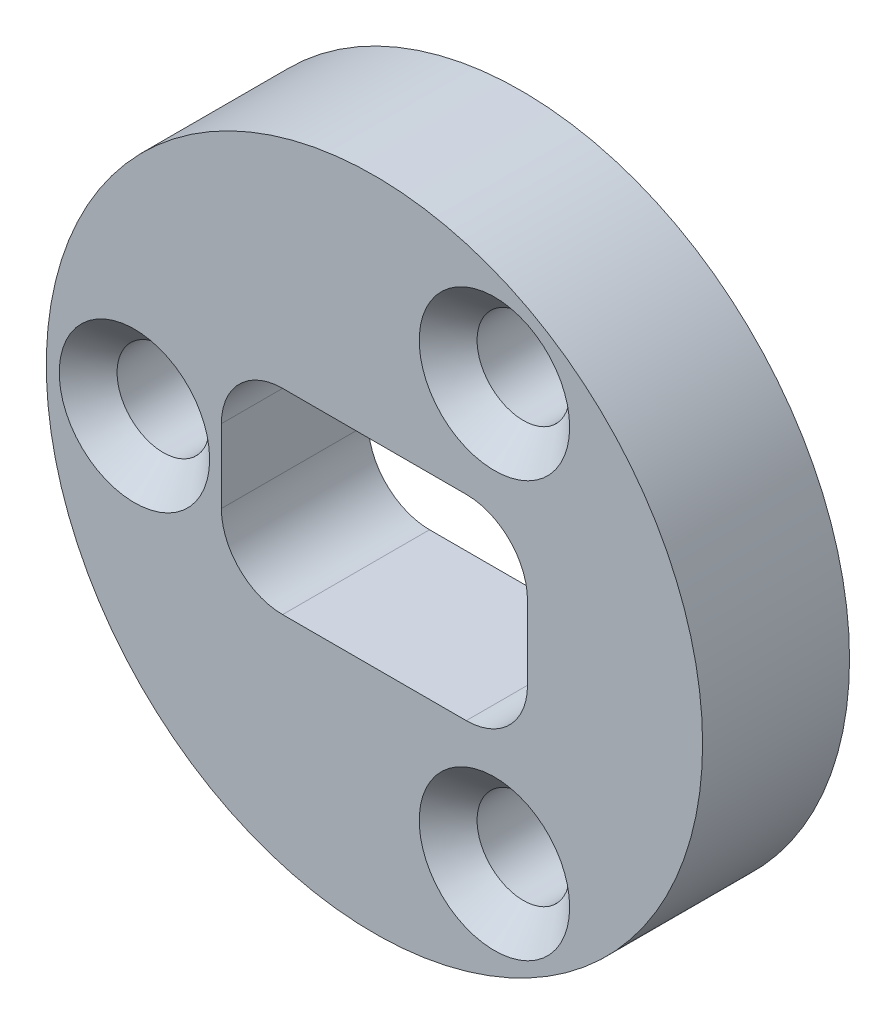
ISO-10303-21;
HEADER;
FILE_DESCRIPTION(('STEP AP214'),'2;1');
FILE_NAME('part.step','',(''),(''),'','','');
FILE_SCHEMA(('AUTOMOTIVE_DESIGN { 1 0 10303 214 1 1 1 1 }'));
ENDSEC;
DATA;
#1=APPLICATION_CONTEXT('core data for automotive mechanical design processes');
#2=APPLICATION_PROTOCOL_DEFINITION('international standard','automotive_design',2000,#1);
#3=PRODUCT_CONTEXT('',#1,'mechanical');
#4=PRODUCT('Part','Part','',(#3));
#5=PRODUCT_RELATED_PRODUCT_CATEGORY('part','',(#4));
#6=PRODUCT_DEFINITION_FORMATION('','',#4);
#7=PRODUCT_DEFINITION_CONTEXT('part definition',#1,'design');
#8=PRODUCT_DEFINITION('design','',#6,#7);
#9=PRODUCT_DEFINITION_SHAPE('','',#8);
#10=(LENGTH_UNIT() NAMED_UNIT(*) SI_UNIT(.MILLI.,.METRE.));
#11=(NAMED_UNIT(*) PLANE_ANGLE_UNIT() SI_UNIT($,.RADIAN.));
#12=(NAMED_UNIT(*) SI_UNIT($,.STERADIAN.) SOLID_ANGLE_UNIT());
#13=UNCERTAINTY_MEASURE_WITH_UNIT(LENGTH_MEASURE(1.E-05),#10,'distance_accuracy_value','');
#14=(GEOMETRIC_REPRESENTATION_CONTEXT(3) GLOBAL_UNCERTAINTY_ASSIGNED_CONTEXT((#13)) GLOBAL_UNIT_ASSIGNED_CONTEXT((#10,
#11,#12)) REPRESENTATION_CONTEXT('',''));
#15=CARTESIAN_POINT('',(0.,0.,0.));
#16=DIRECTION('',(0.,0.,1.));
#17=DIRECTION('',(1.,0.,0.));
#18=AXIS2_PLACEMENT_3D('',#15,#16,#17);
#19=CARTESIAN_POINT('',(0.,0.,3.81));
#20=DIRECTION('',(0.,0.,-1.));
#21=DIRECTION('',(-1.,0.,0.));
#22=AXIS2_PLACEMENT_3D('',#19,#20,#21);
#23=CYLINDRICAL_SURFACE('',#22,8.509);
#24=CARTESIAN_POINT('',(0.,0.,3.81));
#25=DIRECTION('',(0.,0.,1.));
#26=DIRECTION('',(1.,0.,0.));
#27=AXIS2_PLACEMENT_3D('',#24,#25,#26);
#28=CIRCLE('',#27,8.509);
#29=CARTESIAN_POINT('',(8.509,0.,3.81));
#30=VERTEX_POINT('',#29);
#31=EDGE_CURVE('E152',#30,#30,#28,.T.);
#32=ORIENTED_EDGE('',*,*,#31,.F.);
#33=EDGE_LOOP('',(#32));
#34=FACE_BOUND('',#33,.T.);
#35=CARTESIAN_POINT('',(0.,0.,0.));
#36=DIRECTION('',(0.,0.,1.));
#37=DIRECTION('',(1.,0.,0.));
#38=AXIS2_PLACEMENT_3D('',#35,#36,#37);
#39=CIRCLE('',#38,8.509);
#40=CARTESIAN_POINT('',(8.509,0.,0.));
#41=VERTEX_POINT('',#40);
#42=EDGE_CURVE('E156',#41,#41,#39,.T.);
#43=ORIENTED_EDGE('',*,*,#42,.T.);
#44=EDGE_LOOP('',(#43));
#45=FACE_BOUND('',#44,.T.);
#46=ADVANCED_FACE('F41',(#34,#45),#23,.T.);
#47=CARTESIAN_POINT('',(0.,0.,3.81));
#48=DIRECTION('',(0.,0.,1.));
#49=DIRECTION('',(1.,0.,0.));
#50=AXIS2_PLACEMENT_3D('',#47,#48,#49);
#51=PLANE('',#50);
#52=CARTESIAN_POINT('',(3.11150000000005,-5.38927608775056,3.81));
#53=DIRECTION('',(0.,0.,1.));
#54=DIRECTION('',(1.,0.,0.));
#55=AXIS2_PLACEMENT_3D('',#52,#53,#54);
#56=CIRCLE('',#55,1.94999999999999);
#57=CARTESIAN_POINT('',(5.06150000000004,-5.38927608775056,3.81));
#58=VERTEX_POINT('',#57);
#59=EDGE_CURVE('E210',#58,#58,#56,.F.);
#60=ORIENTED_EDGE('',*,*,#59,.T.);
#61=EDGE_LOOP('',(#60));
#62=FACE_BOUND('',#61,.T.);
#63=CARTESIAN_POINT('',(-6.223,0.,3.81));
#64=DIRECTION('',(0.,0.,1.));
#65=DIRECTION('',(1.,0.,0.));
#66=AXIS2_PLACEMENT_3D('',#63,#64,#65);
#67=CIRCLE('',#66,1.94999999999999);
#68=CARTESIAN_POINT('',(-4.27300000000001,0.,3.81));
#69=VERTEX_POINT('',#68);
#70=EDGE_CURVE('E206',#69,#69,#67,.F.);
#71=ORIENTED_EDGE('',*,*,#70,.T.);
#72=EDGE_LOOP('',(#71));
#73=FACE_BOUND('',#72,.T.);
#74=CARTESIAN_POINT('',(3.11150000000003,5.38927608775061,3.81));
#75=DIRECTION('',(0.,0.,1.));
#76=DIRECTION('',(1.,0.,0.));
#77=AXIS2_PLACEMENT_3D('',#74,#75,#76);
#78=CIRCLE('',#77,1.94999999999999);
#79=CARTESIAN_POINT('',(5.06150000000002,5.38927608775061,3.81));
#80=VERTEX_POINT('',#79);
#81=EDGE_CURVE('E202',#80,#80,#78,.F.);
#82=ORIENTED_EDGE('',*,*,#81,.T.);
#83=EDGE_LOOP('',(#82));
#84=FACE_BOUND('',#83,.T.);
#85=DIRECTION('',(0.,-1.,0.));
#86=VECTOR('',#85,1.);
#87=CARTESIAN_POINT('',(-3.96875,2.54,3.81));
#88=LINE('',#87,#86);
#89=CARTESIAN_POINT('',(-3.96875,0.9525,3.81));
#90=VERTEX_POINT('',#89);
#91=CARTESIAN_POINT('',(-3.96875,-0.952500000000001,3.81));
#92=VERTEX_POINT('',#91);
#93=EDGE_CURVE('E148',#90,#92,#88,.T.);
#94=ORIENTED_EDGE('',*,*,#93,.F.);
#95=CARTESIAN_POINT('',(-2.38125,0.9525,3.81));
#96=DIRECTION('',(0.,0.,1.));
#97=DIRECTION('',(1.,0.,0.));
#98=AXIS2_PLACEMENT_3D('',#95,#96,#97);
#99=CIRCLE('',#98,1.5875);
#100=CARTESIAN_POINT('',(-2.38125,2.54,3.81));
#101=VERTEX_POINT('',#100);
#102=EDGE_CURVE('E192',#90,#101,#99,.F.);
#103=ORIENTED_EDGE('',*,*,#102,.T.);
#104=DIRECTION('',(-1.,0.,0.));
#105=VECTOR('',#104,1.);
#106=CARTESIAN_POINT('',(-3.96875,2.54,3.81));
#107=LINE('',#106,#105);
#108=CARTESIAN_POINT('',(2.38125,2.54,3.81));
#109=VERTEX_POINT('',#108);
#110=EDGE_CURVE('E141',#109,#101,#107,.T.);
#111=ORIENTED_EDGE('',*,*,#110,.F.);
#112=CARTESIAN_POINT('',(2.38125,0.9525,3.81));
#113=DIRECTION('',(0.,0.,1.));
#114=DIRECTION('',(1.,0.,0.));
#115=AXIS2_PLACEMENT_3D('',#112,#113,#114);
#116=CIRCLE('',#115,1.5875);
#117=CARTESIAN_POINT('',(3.96875,0.9525,3.81));
#118=VERTEX_POINT('',#117);
#119=EDGE_CURVE('E139',#109,#118,#116,.F.);
#120=ORIENTED_EDGE('',*,*,#119,.T.);
#121=DIRECTION('',(0.,1.,0.));
#122=VECTOR('',#121,1.);
#123=CARTESIAN_POINT('',(3.96875,2.54,3.81));
#124=LINE('',#123,#122);
#125=CARTESIAN_POINT('',(3.96875,-0.952500000000002,3.81));
#126=VERTEX_POINT('',#125);
#127=EDGE_CURVE('E128',#126,#118,#124,.T.);
#128=ORIENTED_EDGE('',*,*,#127,.F.);
#129=CARTESIAN_POINT('',(2.38125,-0.952500000000001,3.81));
#130=DIRECTION('',(0.,0.,1.));
#131=DIRECTION('',(1.,0.,0.));
#132=AXIS2_PLACEMENT_3D('',#129,#130,#131);
#133=CIRCLE('',#132,1.5875);
#134=CARTESIAN_POINT('',(2.38125,-2.54,3.81));
#135=VERTEX_POINT('',#134);
#136=EDGE_CURVE('E110',#126,#135,#133,.F.);
#137=ORIENTED_EDGE('',*,*,#136,.T.);
#138=DIRECTION('',(1.,0.,0.));
#139=VECTOR('',#138,1.);
#140=CARTESIAN_POINT('',(-3.96875,-2.54,3.81));
#141=LINE('',#140,#139);
#142=CARTESIAN_POINT('',(-2.38125,-2.54,3.81));
#143=VERTEX_POINT('',#142);
#144=EDGE_CURVE('E142',#143,#135,#141,.T.);
#145=ORIENTED_EDGE('',*,*,#144,.F.);
#146=CARTESIAN_POINT('',(-2.38125,-0.952500000000001,3.81));
#147=DIRECTION('',(0.,0.,1.));
#148=DIRECTION('',(1.,0.,0.));
#149=AXIS2_PLACEMENT_3D('',#146,#147,#148);
#150=CIRCLE('',#149,1.5875);
#151=EDGE_CURVE('E182',#143,#92,#150,.F.);
#152=ORIENTED_EDGE('',*,*,#151,.T.);
#153=EDGE_LOOP('',(#94,#103,#111,#120,#128,#137,#145,#152));
#154=FACE_BOUND('',#153,.T.);
#155=ORIENTED_EDGE('',*,*,#31,.T.);
#156=EDGE_LOOP('',(#155));
#157=FACE_BOUND('',#156,.T.);
#158=ADVANCED_FACE('F136',(#62,#73,#84,#154,#157),#51,.T.);
#159=CARTESIAN_POINT('',(0.,0.,0.));
#160=DIRECTION('',(0.,0.,1.));
#161=DIRECTION('',(1.,0.,0.));
#162=AXIS2_PLACEMENT_3D('',#159,#160,#161);
#163=PLANE('',#162);
#164=CARTESIAN_POINT('',(-6.223,0.,0.));
#165=DIRECTION('',(0.,0.,1.));
#166=DIRECTION('',(1.,0.,0.));
#167=AXIS2_PLACEMENT_3D('',#164,#165,#166);
#168=CIRCLE('',#167,1.2);
#169=CARTESIAN_POINT('',(-5.023,0.,0.));
#170=VERTEX_POINT('',#169);
#171=EDGE_CURVE('E300',#170,#170,#168,.T.);
#172=ORIENTED_EDGE('',*,*,#171,.T.);
#173=EDGE_LOOP('',(#172));
#174=FACE_BOUND('',#173,.T.);
#175=CARTESIAN_POINT('',(3.11150000000003,5.38927608775061,0.));
#176=DIRECTION('',(0.,0.,1.));
#177=DIRECTION('',(1.,0.,0.));
#178=AXIS2_PLACEMENT_3D('',#175,#176,#177);
#179=CIRCLE('',#178,1.2);
#180=CARTESIAN_POINT('',(4.31150000000003,5.38927608775061,0.));
#181=VERTEX_POINT('',#180);
#182=EDGE_CURVE('E295',#181,#181,#179,.T.);
#183=ORIENTED_EDGE('',*,*,#182,.T.);
#184=EDGE_LOOP('',(#183));
#185=FACE_BOUND('',#184,.T.);
#186=CARTESIAN_POINT('',(3.11150000000005,-5.38927608775056,0.));
#187=DIRECTION('',(0.,0.,1.));
#188=DIRECTION('',(1.,0.,0.));
#189=AXIS2_PLACEMENT_3D('',#186,#187,#188);
#190=CIRCLE('',#189,1.2);
#191=CARTESIAN_POINT('',(4.31150000000005,-5.38927608775056,0.));
#192=VERTEX_POINT('',#191);
#193=EDGE_CURVE('E286',#192,#192,#190,.T.);
#194=ORIENTED_EDGE('',*,*,#193,.T.);
#195=EDGE_LOOP('',(#194));
#196=FACE_BOUND('',#195,.T.);
#197=DIRECTION('',(0.,1.,0.));
#198=VECTOR('',#197,1.);
#199=CARTESIAN_POINT('',(3.96875,2.54,0.));
#200=LINE('',#199,#198);
#201=CARTESIAN_POINT('',(3.96875,-0.952500000000002,0.));
#202=VERTEX_POINT('',#201);
#203=CARTESIAN_POINT('',(3.96875,0.9525,0.));
#204=VERTEX_POINT('',#203);
#205=EDGE_CURVE('E130',#202,#204,#200,.T.);
#206=ORIENTED_EDGE('',*,*,#205,.T.);
#207=CARTESIAN_POINT('',(2.38125,0.9525,0.));
#208=DIRECTION('',(0.,0.,1.));
#209=DIRECTION('',(1.,0.,0.));
#210=AXIS2_PLACEMENT_3D('',#207,#208,#209);
#211=CIRCLE('',#210,1.5875);
#212=CARTESIAN_POINT('',(2.38125,2.54,0.));
#213=VERTEX_POINT('',#212);
#214=EDGE_CURVE('E65',#204,#213,#211,.T.);
#215=ORIENTED_EDGE('',*,*,#214,.T.);
#216=DIRECTION('',(-1.,0.,0.));
#217=VECTOR('',#216,1.);
#218=CARTESIAN_POINT('',(-3.96875,2.54,0.));
#219=LINE('',#218,#217);
#220=CARTESIAN_POINT('',(-2.38125,2.54,0.));
#221=VERTEX_POINT('',#220);
#222=EDGE_CURVE('E160',#213,#221,#219,.T.);
#223=ORIENTED_EDGE('',*,*,#222,.T.);
#224=CARTESIAN_POINT('',(-2.38125,0.9525,0.));
#225=DIRECTION('',(0.,0.,1.));
#226=DIRECTION('',(1.,0.,0.));
#227=AXIS2_PLACEMENT_3D('',#224,#225,#226);
#228=CIRCLE('',#227,1.5875);
#229=CARTESIAN_POINT('',(-3.96875,0.9525,0.));
#230=VERTEX_POINT('',#229);
#231=EDGE_CURVE('E195',#221,#230,#228,.T.);
#232=ORIENTED_EDGE('',*,*,#231,.T.);
#233=DIRECTION('',(0.,-1.,0.));
#234=VECTOR('',#233,1.);
#235=CARTESIAN_POINT('',(-3.96875,2.54,0.));
#236=LINE('',#235,#234);
#237=CARTESIAN_POINT('',(-3.96875,-0.952500000000001,0.));
#238=VERTEX_POINT('',#237);
#239=EDGE_CURVE('E146',#230,#238,#236,.T.);
#240=ORIENTED_EDGE('',*,*,#239,.T.);
#241=CARTESIAN_POINT('',(-2.38125,-0.952500000000001,0.));
#242=DIRECTION('',(0.,0.,1.));
#243=DIRECTION('',(1.,0.,0.));
#244=AXIS2_PLACEMENT_3D('',#241,#242,#243);
#245=CIRCLE('',#244,1.5875);
#246=CARTESIAN_POINT('',(-2.38125,-2.54,0.));
#247=VERTEX_POINT('',#246);
#248=EDGE_CURVE('E185',#238,#247,#245,.T.);
#249=ORIENTED_EDGE('',*,*,#248,.T.);
#250=DIRECTION('',(1.,0.,0.));
#251=VECTOR('',#250,1.);
#252=CARTESIAN_POINT('',(-3.96875,-2.54,0.));
#253=LINE('',#252,#251);
#254=CARTESIAN_POINT('',(2.38125,-2.54,0.));
#255=VERTEX_POINT('',#254);
#256=EDGE_CURVE('E280',#247,#255,#253,.T.);
#257=ORIENTED_EDGE('',*,*,#256,.T.);
#258=CARTESIAN_POINT('',(2.38125,-0.952500000000001,0.));
#259=DIRECTION('',(0.,0.,1.));
#260=DIRECTION('',(1.,0.,0.));
#261=AXIS2_PLACEMENT_3D('',#258,#259,#260);
#262=CIRCLE('',#261,1.5875);
#263=EDGE_CURVE('E121',#255,#202,#262,.T.);
#264=ORIENTED_EDGE('',*,*,#263,.T.);
#265=EDGE_LOOP('',(#206,#215,#223,#232,#240,#249,#257,#264));
#266=FACE_BOUND('',#265,.T.);
#267=ORIENTED_EDGE('',*,*,#42,.F.);
#268=EDGE_LOOP('',(#267));
#269=FACE_BOUND('',#268,.T.);
#270=ADVANCED_FACE('F241',(#174,#185,#196,#266,#269),#163,.F.);
#271=CARTESIAN_POINT('',(-3.96875,2.54,0.));
#272=DIRECTION('',(-1.,0.,0.));
#273=DIRECTION('',(0.,-1.,0.));
#274=AXIS2_PLACEMENT_3D('',#271,#272,#273);
#275=PLANE('',#274);
#276=ORIENTED_EDGE('',*,*,#93,.T.);
#277=DIRECTION('',(0.,0.,1.));
#278=VECTOR('',#277,1.);
#279=CARTESIAN_POINT('',(-3.96875,-0.952500000000001,0.));
#280=LINE('',#279,#278);
#281=EDGE_CURVE('E172',#92,#238,#280,.F.);
#282=ORIENTED_EDGE('',*,*,#281,.T.);
#283=ORIENTED_EDGE('',*,*,#239,.F.);
#284=DIRECTION('',(0.,0.,1.));
#285=VECTOR('',#284,1.);
#286=CARTESIAN_POINT('',(-3.96875,0.9525,3.81));
#287=LINE('',#286,#285);
#288=EDGE_CURVE('E168',#230,#90,#287,.T.);
#289=ORIENTED_EDGE('',*,*,#288,.T.);
#290=EDGE_LOOP('',(#276,#282,#283,#289));
#291=FACE_BOUND('',#290,.T.);
#292=ADVANCED_FACE('F277',(#291),#275,.F.);
#293=CARTESIAN_POINT('',(-3.96875,2.54,0.));
#294=DIRECTION('',(0.,1.,0.));
#295=DIRECTION('',(0.,0.,1.));
#296=AXIS2_PLACEMENT_3D('',#293,#294,#295);
#297=PLANE('',#296);
#298=ORIENTED_EDGE('',*,*,#222,.F.);
#299=DIRECTION('',(0.,0.,1.));
#300=VECTOR('',#299,1.);
#301=CARTESIAN_POINT('',(2.38125,2.54,3.81));
#302=LINE('',#301,#300);
#303=EDGE_CURVE('E122',#213,#109,#302,.T.);
#304=ORIENTED_EDGE('',*,*,#303,.T.);
#305=ORIENTED_EDGE('',*,*,#110,.T.);
#306=DIRECTION('',(0.,0.,1.));
#307=VECTOR('',#306,1.);
#308=CARTESIAN_POINT('',(-2.38125,2.54,0.));
#309=LINE('',#308,#307);
#310=EDGE_CURVE('E58',#101,#221,#309,.F.);
#311=ORIENTED_EDGE('',*,*,#310,.T.);
#312=EDGE_LOOP('',(#298,#304,#305,#311));
#313=FACE_BOUND('',#312,.T.);
#314=ADVANCED_FACE('F323',(#313),#297,.F.);
#315=CARTESIAN_POINT('',(3.96875,2.54,0.));
#316=DIRECTION('',(1.,0.,0.));
#317=DIRECTION('',(0.,1.,0.));
#318=AXIS2_PLACEMENT_3D('',#315,#316,#317);
#319=PLANE('',#318);
#320=ORIENTED_EDGE('',*,*,#205,.F.);
#321=DIRECTION('',(0.,0.,1.));
#322=VECTOR('',#321,1.);
#323=CARTESIAN_POINT('',(3.96875,-0.952500000000001,3.81));
#324=LINE('',#323,#322);
#325=EDGE_CURVE('E114',#202,#126,#324,.T.);
#326=ORIENTED_EDGE('',*,*,#325,.T.);
#327=ORIENTED_EDGE('',*,*,#127,.T.);
#328=DIRECTION('',(0.,0.,1.));
#329=VECTOR('',#328,1.);
#330=CARTESIAN_POINT('',(3.96875,0.9525,0.));
#331=LINE('',#330,#329);
#332=EDGE_CURVE('E133',#118,#204,#331,.F.);
#333=ORIENTED_EDGE('',*,*,#332,.T.);
#334=EDGE_LOOP('',(#320,#326,#327,#333));
#335=FACE_BOUND('',#334,.T.);
#336=ADVANCED_FACE('F127',(#335),#319,.F.);
#337=CARTESIAN_POINT('',(-3.96875,-2.54,0.));
#338=DIRECTION('',(0.,-1.,0.));
#339=DIRECTION('',(0.,0.,-1.));
#340=AXIS2_PLACEMENT_3D('',#337,#338,#339);
#341=PLANE('',#340);
#342=ORIENTED_EDGE('',*,*,#144,.T.);
#343=DIRECTION('',(0.,0.,1.));
#344=VECTOR('',#343,1.);
#345=CARTESIAN_POINT('',(2.38125,-2.54,0.));
#346=LINE('',#345,#344);
#347=EDGE_CURVE('E115',#135,#255,#346,.F.);
#348=ORIENTED_EDGE('',*,*,#347,.T.);
#349=ORIENTED_EDGE('',*,*,#256,.F.);
#350=DIRECTION('',(0.,0.,1.));
#351=VECTOR('',#350,1.);
#352=CARTESIAN_POINT('',(-2.38125,-2.54,3.81));
#353=LINE('',#352,#351);
#354=EDGE_CURVE('E132',#247,#143,#353,.T.);
#355=ORIENTED_EDGE('',*,*,#354,.T.);
#356=EDGE_LOOP('',(#342,#348,#349,#355));
#357=FACE_BOUND('',#356,.T.);
#358=ADVANCED_FACE('F321',(#357),#341,.F.);
#359=CARTESIAN_POINT('',(3.11150000000005,-5.38927608775056,3.81));
#360=DIRECTION('',(0.,0.,1.));
#361=DIRECTION('',(1.,0.,0.));
#362=AXIS2_PLACEMENT_3D('',#359,#360,#361);
#363=CYLINDRICAL_SURFACE('',#362,1.19999999999999);
#364=CARTESIAN_POINT('',(3.11150000000005,-5.38927608775056,3.06000000000001));
#365=DIRECTION('',(0.,0.,1.));
#366=DIRECTION('',(1.,0.,0.));
#367=AXIS2_PLACEMENT_3D('',#364,#365,#366);
#368=CIRCLE('',#367,1.19999999999999);
#369=CARTESIAN_POINT('',(4.31150000000005,-5.38927608775056,3.06000000000001));
#370=VERTEX_POINT('',#369);
#371=EDGE_CURVE('E198',#370,#370,#368,.T.);
#372=ORIENTED_EDGE('',*,*,#371,.T.);
#373=EDGE_LOOP('',(#372));
#374=FACE_BOUND('',#373,.T.);
#375=ORIENTED_EDGE('',*,*,#193,.F.);
#376=EDGE_LOOP('',(#375));
#377=FACE_BOUND('',#376,.T.);
#378=ADVANCED_FACE('F315',(#374,#377),#363,.F.);
#379=CARTESIAN_POINT('',(3.11150000000003,5.38927608775061,3.81));
#380=DIRECTION('',(0.,0.,1.));
#381=DIRECTION('',(1.,0.,0.));
#382=AXIS2_PLACEMENT_3D('',#379,#380,#381);
#383=CYLINDRICAL_SURFACE('',#382,1.19999999999999);
#384=CARTESIAN_POINT('',(3.11150000000003,5.38927608775061,3.06000000000001));
#385=DIRECTION('',(0.,0.,1.));
#386=DIRECTION('',(1.,0.,0.));
#387=AXIS2_PLACEMENT_3D('',#384,#385,#386);
#388=CIRCLE('',#387,1.19999999999999);
#389=CARTESIAN_POINT('',(4.31150000000002,5.38927608775061,3.06000000000001));
#390=VERTEX_POINT('',#389);
#391=EDGE_CURVE('E11',#390,#390,#388,.T.);
#392=ORIENTED_EDGE('',*,*,#391,.T.);
#393=EDGE_LOOP('',(#392));
#394=FACE_BOUND('',#393,.T.);
#395=ORIENTED_EDGE('',*,*,#182,.F.);
#396=EDGE_LOOP('',(#395));
#397=FACE_BOUND('',#396,.T.);
#398=ADVANCED_FACE('F309',(#394,#397),#383,.F.);
#399=CARTESIAN_POINT('',(-6.223,0.,3.81));
#400=DIRECTION('',(0.,0.,1.));
#401=DIRECTION('',(1.,0.,0.));
#402=AXIS2_PLACEMENT_3D('',#399,#400,#401);
#403=CYLINDRICAL_SURFACE('',#402,1.19999999999999);
#404=CARTESIAN_POINT('',(-6.223,0.,3.06000000000001));
#405=DIRECTION('',(0.,0.,1.));
#406=DIRECTION('',(1.,0.,0.));
#407=AXIS2_PLACEMENT_3D('',#404,#405,#406);
#408=CIRCLE('',#407,1.19999999999999);
#409=CARTESIAN_POINT('',(-5.02300000000001,0.,3.06000000000001));
#410=VERTEX_POINT('',#409);
#411=EDGE_CURVE('E51',#410,#410,#408,.T.);
#412=ORIENTED_EDGE('',*,*,#411,.T.);
#413=EDGE_LOOP('',(#412));
#414=FACE_BOUND('',#413,.T.);
#415=ORIENTED_EDGE('',*,*,#171,.F.);
#416=EDGE_LOOP('',(#415));
#417=FACE_BOUND('',#416,.T.);
#418=ADVANCED_FACE('F217',(#414,#417),#403,.F.);
#419=CARTESIAN_POINT('',(2.38125,-0.952500000000001,0.));
#420=DIRECTION('',(0.,0.,-1.));
#421=DIRECTION('',(-1.,0.,0.));
#422=AXIS2_PLACEMENT_3D('',#419,#420,#421);
#423=CYLINDRICAL_SURFACE('',#422,1.5875);
#424=ORIENTED_EDGE('',*,*,#263,.F.);
#425=ORIENTED_EDGE('',*,*,#347,.F.);
#426=ORIENTED_EDGE('',*,*,#136,.F.);
#427=ORIENTED_EDGE('',*,*,#325,.F.);
#428=EDGE_LOOP('',(#424,#425,#426,#427));
#429=FACE_BOUND('',#428,.T.);
#430=ADVANCED_FACE('F113',(#429),#423,.F.);
#431=CARTESIAN_POINT('',(-2.38125,-0.952500000000001,0.));
#432=DIRECTION('',(0.,0.,-1.));
#433=DIRECTION('',(-1.,0.,0.));
#434=AXIS2_PLACEMENT_3D('',#431,#432,#433);
#435=CYLINDRICAL_SURFACE('',#434,1.5875);
#436=ORIENTED_EDGE('',*,*,#248,.F.);
#437=ORIENTED_EDGE('',*,*,#281,.F.);
#438=ORIENTED_EDGE('',*,*,#151,.F.);
#439=ORIENTED_EDGE('',*,*,#354,.F.);
#440=EDGE_LOOP('',(#436,#437,#438,#439));
#441=FACE_BOUND('',#440,.T.);
#442=ADVANCED_FACE('F250',(#441),#435,.F.);
#443=CARTESIAN_POINT('',(2.38125,0.9525,0.));
#444=DIRECTION('',(0.,0.,-1.));
#445=DIRECTION('',(-1.,0.,0.));
#446=AXIS2_PLACEMENT_3D('',#443,#444,#445);
#447=CYLINDRICAL_SURFACE('',#446,1.5875);
#448=ORIENTED_EDGE('',*,*,#214,.F.);
#449=ORIENTED_EDGE('',*,*,#332,.F.);
#450=ORIENTED_EDGE('',*,*,#119,.F.);
#451=ORIENTED_EDGE('',*,*,#303,.F.);
#452=EDGE_LOOP('',(#448,#449,#450,#451));
#453=FACE_BOUND('',#452,.T.);
#454=ADVANCED_FACE('F253',(#453),#447,.F.);
#455=CARTESIAN_POINT('',(-2.38125,0.9525,0.));
#456=DIRECTION('',(0.,0.,-1.));
#457=DIRECTION('',(-1.,0.,0.));
#458=AXIS2_PLACEMENT_3D('',#455,#456,#457);
#459=CYLINDRICAL_SURFACE('',#458,1.5875);
#460=ORIENTED_EDGE('',*,*,#231,.F.);
#461=ORIENTED_EDGE('',*,*,#310,.F.);
#462=ORIENTED_EDGE('',*,*,#102,.F.);
#463=ORIENTED_EDGE('',*,*,#288,.F.);
#464=EDGE_LOOP('',(#460,#461,#462,#463));
#465=FACE_BOUND('',#464,.T.);
#466=ADVANCED_FACE('F229',(#465),#459,.F.);
#467=CARTESIAN_POINT('',(3.11150000000005,-5.38927608775056,3.06000000000001));
#468=DIRECTION('',(0.,0.,1.));
#469=DIRECTION('',(1.,0.,0.));
#470=AXIS2_PLACEMENT_3D('',#467,#468,#469);
#471=CONICAL_SURFACE('',#470,1.19999999999999,0.78539816339745);
#472=ORIENTED_EDGE('',*,*,#59,.F.);
#473=EDGE_LOOP('',(#472));
#474=FACE_BOUND('',#473,.T.);
#475=ORIENTED_EDGE('',*,*,#371,.F.);
#476=EDGE_LOOP('',(#475));
#477=FACE_BOUND('',#476,.T.);
#478=ADVANCED_FACE('F222',(#474,#477),#471,.F.);
#479=CARTESIAN_POINT('',(-6.223,0.,3.06000000000001));
#480=DIRECTION('',(0.,0.,1.));
#481=DIRECTION('',(1.,0.,0.));
#482=AXIS2_PLACEMENT_3D('',#479,#480,#481);
#483=CONICAL_SURFACE('',#482,1.19999999999999,0.78539816339745);
#484=ORIENTED_EDGE('',*,*,#70,.F.);
#485=EDGE_LOOP('',(#484));
#486=FACE_BOUND('',#485,.T.);
#487=ORIENTED_EDGE('',*,*,#411,.F.);
#488=EDGE_LOOP('',(#487));
#489=FACE_BOUND('',#488,.T.);
#490=ADVANCED_FACE('F220',(#486,#489),#483,.F.);
#491=CARTESIAN_POINT('',(3.11150000000003,5.38927608775061,3.06000000000001));
#492=DIRECTION('',(0.,0.,1.));
#493=DIRECTION('',(1.,0.,0.));
#494=AXIS2_PLACEMENT_3D('',#491,#492,#493);
#495=CONICAL_SURFACE('',#494,1.19999999999999,0.78539816339745);
#496=ORIENTED_EDGE('',*,*,#81,.F.);
#497=EDGE_LOOP('',(#496));
#498=FACE_BOUND('',#497,.T.);
#499=ORIENTED_EDGE('',*,*,#391,.F.);
#500=EDGE_LOOP('',(#499));
#501=FACE_BOUND('',#500,.T.);
#502=ADVANCED_FACE('F44',(#498,#501),#495,.F.);
#503=CLOSED_SHELL('',(#46,#158,#270,#292,#314,#336,#358,#378,#398,#418,#430,#442,#454,#466,#478,
#490,#502));
#504=MANIFOLD_SOLID_BREP('B2',#503);
#505=ADVANCED_BREP_SHAPE_REPRESENTATION('',(#18,#504),#14);
#506=SHAPE_DEFINITION_REPRESENTATION(#9,#505);
ENDSEC;
END-ISO-10303-21;
